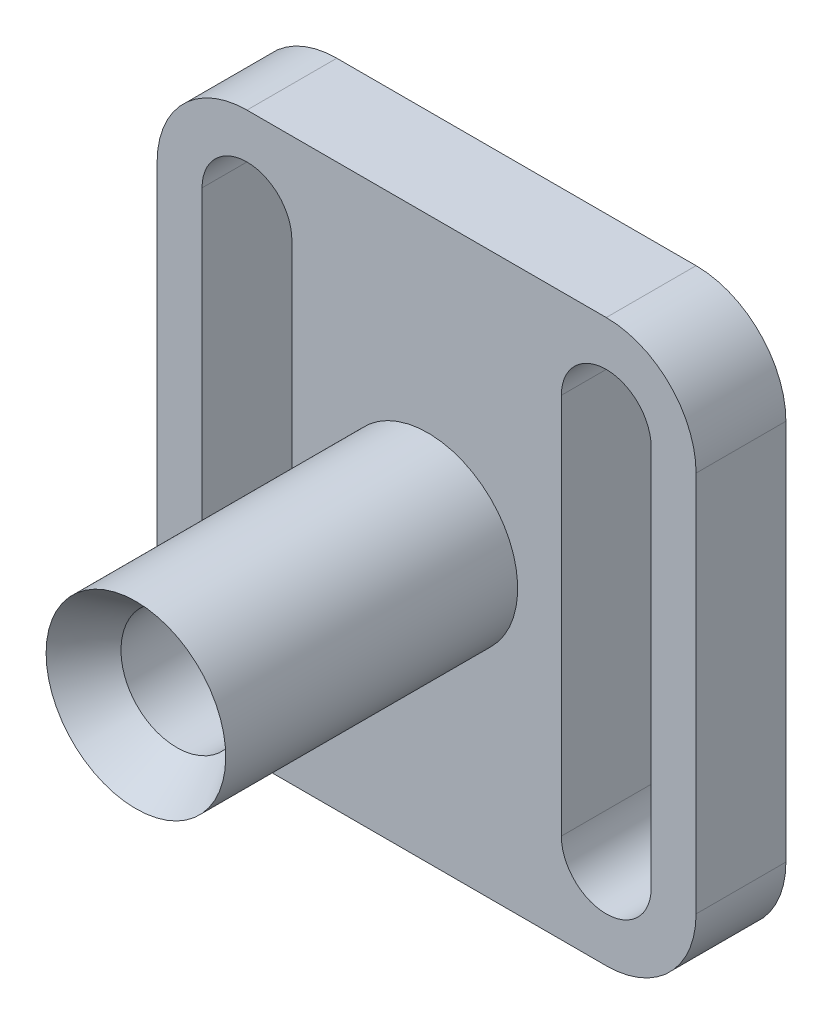
ISO-10303-21;
HEADER;
FILE_DESCRIPTION(('STEP AP214'),'2;1');
FILE_NAME('part.step','',(''),(''),'','','');
FILE_SCHEMA(('AUTOMOTIVE_DESIGN { 1 0 10303 214 1 1 1 1 }'));
ENDSEC;
DATA;
#1=APPLICATION_CONTEXT('core data for automotive mechanical design processes');
#2=APPLICATION_PROTOCOL_DEFINITION('international standard','automotive_design',2000,#1);
#3=PRODUCT_CONTEXT('',#1,'mechanical');
#4=PRODUCT('Part','Part','',(#3));
#5=PRODUCT_RELATED_PRODUCT_CATEGORY('part','',(#4));
#6=PRODUCT_DEFINITION_FORMATION('','',#4);
#7=PRODUCT_DEFINITION_CONTEXT('part definition',#1,'design');
#8=PRODUCT_DEFINITION('design','',#6,#7);
#9=PRODUCT_DEFINITION_SHAPE('','',#8);
#10=(LENGTH_UNIT() NAMED_UNIT(*) SI_UNIT(.MILLI.,.METRE.));
#11=(NAMED_UNIT(*) PLANE_ANGLE_UNIT() SI_UNIT($,.RADIAN.));
#12=(NAMED_UNIT(*) SI_UNIT($,.STERADIAN.) SOLID_ANGLE_UNIT());
#13=UNCERTAINTY_MEASURE_WITH_UNIT(LENGTH_MEASURE(1.E-05),#10,'distance_accuracy_value','');
#14=(GEOMETRIC_REPRESENTATION_CONTEXT(3) GLOBAL_UNCERTAINTY_ASSIGNED_CONTEXT((#13)) GLOBAL_UNIT_ASSIGNED_CONTEXT((#10,
#11,#12)) REPRESENTATION_CONTEXT('',''));
#15=CARTESIAN_POINT('',(0.,0.,0.));
#16=DIRECTION('',(0.,0.,1.));
#17=DIRECTION('',(1.,0.,0.));
#18=AXIS2_PLACEMENT_3D('',#15,#16,#17);
#19=CARTESIAN_POINT('',(6.35,6.35,6.35));
#20=DIRECTION('',(0.,0.,-1.));
#21=DIRECTION('',(-1.,0.,0.));
#22=AXIS2_PLACEMENT_3D('',#19,#20,#21);
#23=PLANE('',#22);
#24=CARTESIAN_POINT('',(19.1389366212312,19.9751458985905,6.35));
#25=DIRECTION('',(0.,0.,-1.));
#26=DIRECTION('',(-1.,0.,0.));
#27=AXIS2_PLACEMENT_3D('',#24,#25,#26);
#28=CIRCLE('',#27,6.35);
#29=CARTESIAN_POINT('',(12.7889366212312,19.9751458985905,6.35));
#30=VERTEX_POINT('',#29);
#31=EDGE_CURVE('E12',#30,#30,#28,.F.);
#32=ORIENTED_EDGE('',*,*,#31,.F.);
#33=EDGE_LOOP('',(#32));
#34=FACE_BOUND('',#33,.T.);
#35=CARTESIAN_POINT('',(6.35,33.3375,6.35));
#36=DIRECTION('',(0.,0.,1.));
#37=DIRECTION('',(1.,0.,0.));
#38=AXIS2_PLACEMENT_3D('',#35,#36,#37);
#39=CIRCLE('',#38,3.175);
#40=CARTESIAN_POINT('',(9.525,33.3375,6.35));
#41=VERTEX_POINT('',#40);
#42=CARTESIAN_POINT('',(3.175,33.3375,6.35));
#43=VERTEX_POINT('',#42);
#44=EDGE_CURVE('E192',#41,#43,#39,.T.);
#45=ORIENTED_EDGE('',*,*,#44,.F.);
#46=DIRECTION('',(0.,1.,0.));
#47=VECTOR('',#46,1.);
#48=CARTESIAN_POINT('',(9.525,33.3375,6.35));
#49=LINE('',#48,#47);
#50=CARTESIAN_POINT('',(9.52500000000001,6.35,6.35));
#51=VERTEX_POINT('',#50);
#52=EDGE_CURVE('E200',#51,#41,#49,.T.);
#53=ORIENTED_EDGE('',*,*,#52,.F.);
#54=CARTESIAN_POINT('',(6.35,6.35,6.35));
#55=DIRECTION('',(0.,0.,1.));
#56=DIRECTION('',(1.,0.,0.));
#57=AXIS2_PLACEMENT_3D('',#54,#55,#56);
#58=CIRCLE('',#57,3.175);
#59=CARTESIAN_POINT('',(3.175,6.35,6.35));
#60=VERTEX_POINT('',#59);
#61=EDGE_CURVE('E197',#60,#51,#58,.T.);
#62=ORIENTED_EDGE('',*,*,#61,.F.);
#63=DIRECTION('',(0.,-1.,0.));
#64=VECTOR('',#63,1.);
#65=CARTESIAN_POINT('',(3.175,33.3375,6.35));
#66=LINE('',#65,#64);
#67=EDGE_CURVE('E194',#43,#60,#66,.T.);
#68=ORIENTED_EDGE('',*,*,#67,.F.);
#69=EDGE_LOOP('',(#45,#53,#62,#68));
#70=FACE_BOUND('',#69,.T.);
#71=CARTESIAN_POINT('',(6.35,6.35,6.35));
#72=DIRECTION('',(0.,0.,1.));
#73=DIRECTION('',(-1.,0.,0.));
#74=AXIS2_PLACEMENT_3D('',#71,#72,#73);
#75=CIRCLE('',#74,6.35);
#76=CARTESIAN_POINT('',(0.,6.35,6.35));
#77=VERTEX_POINT('',#76);
#78=CARTESIAN_POINT('',(6.35,0.,6.35));
#79=VERTEX_POINT('',#78);
#80=EDGE_CURVE('E223',#77,#79,#75,.T.);
#81=ORIENTED_EDGE('',*,*,#80,.T.);
#82=DIRECTION('',(1.,0.,0.));
#83=VECTOR('',#82,1.);
#84=CARTESIAN_POINT('',(6.35,0.,6.35));
#85=LINE('',#84,#83);
#86=CARTESIAN_POINT('',(31.75,0.,6.35));
#87=VERTEX_POINT('',#86);
#88=EDGE_CURVE('E226',#79,#87,#85,.T.);
#89=ORIENTED_EDGE('',*,*,#88,.T.);
#90=CARTESIAN_POINT('',(31.75,6.35,6.35));
#91=DIRECTION('',(0.,0.,1.));
#92=DIRECTION('',(1.,0.,0.));
#93=AXIS2_PLACEMENT_3D('',#90,#91,#92);
#94=CIRCLE('',#93,6.35);
#95=CARTESIAN_POINT('',(38.1,6.35,6.35));
#96=VERTEX_POINT('',#95);
#97=EDGE_CURVE('E229',#87,#96,#94,.T.);
#98=ORIENTED_EDGE('',*,*,#97,.T.);
#99=DIRECTION('',(0.,1.,0.));
#100=VECTOR('',#99,1.);
#101=CARTESIAN_POINT('',(38.1,6.35,6.35));
#102=LINE('',#101,#100);
#103=CARTESIAN_POINT('',(38.1,33.3375,6.35));
#104=VERTEX_POINT('',#103);
#105=EDGE_CURVE('E231',#96,#104,#102,.T.);
#106=ORIENTED_EDGE('',*,*,#105,.T.);
#107=CARTESIAN_POINT('',(31.75,33.3375,6.35));
#108=DIRECTION('',(0.,0.,1.));
#109=DIRECTION('',(-1.,0.,0.));
#110=AXIS2_PLACEMENT_3D('',#107,#108,#109);
#111=CIRCLE('',#110,6.35);
#112=CARTESIAN_POINT('',(31.75,39.6875,6.35));
#113=VERTEX_POINT('',#112);
#114=EDGE_CURVE('E233',#104,#113,#111,.T.);
#115=ORIENTED_EDGE('',*,*,#114,.T.);
#116=DIRECTION('',(-1.,0.,0.));
#117=VECTOR('',#116,1.);
#118=CARTESIAN_POINT('',(6.35,39.6875,6.35));
#119=LINE('',#118,#117);
#120=CARTESIAN_POINT('',(6.35,39.6875,6.35));
#121=VERTEX_POINT('',#120);
#122=EDGE_CURVE('E235',#113,#121,#119,.T.);
#123=ORIENTED_EDGE('',*,*,#122,.T.);
#124=CARTESIAN_POINT('',(6.35,33.3375,6.35));
#125=DIRECTION('',(0.,0.,1.));
#126=DIRECTION('',(-1.,0.,0.));
#127=AXIS2_PLACEMENT_3D('',#124,#125,#126);
#128=CIRCLE('',#127,6.35);
#129=CARTESIAN_POINT('',(0.,33.3375,6.35));
#130=VERTEX_POINT('',#129);
#131=EDGE_CURVE('E237',#121,#130,#128,.T.);
#132=ORIENTED_EDGE('',*,*,#131,.T.);
#133=DIRECTION('',(0.,-1.,0.));
#134=VECTOR('',#133,1.);
#135=CARTESIAN_POINT('',(0.,6.35,6.35));
#136=LINE('',#135,#134);
#137=EDGE_CURVE('E239',#130,#77,#136,.T.);
#138=ORIENTED_EDGE('',*,*,#137,.T.);
#139=EDGE_LOOP('',(#81,#89,#98,#106,#115,#123,#132,#138));
#140=FACE_BOUND('',#139,.T.);
#141=CARTESIAN_POINT('',(31.75,33.3375,6.35));
#142=DIRECTION('',(0.,0.,1.));
#143=DIRECTION('',(1.,0.,0.));
#144=AXIS2_PLACEMENT_3D('',#141,#142,#143);
#145=CIRCLE('',#144,3.175);
#146=CARTESIAN_POINT('',(34.925,33.3375,6.35));
#147=VERTEX_POINT('',#146);
#148=CARTESIAN_POINT('',(28.575,33.3375,6.35));
#149=VERTEX_POINT('',#148);
#150=EDGE_CURVE('E154',#147,#149,#145,.T.);
#151=ORIENTED_EDGE('',*,*,#150,.F.);
#152=DIRECTION('',(0.,1.,0.));
#153=VECTOR('',#152,1.);
#154=CARTESIAN_POINT('',(34.925,33.3375,6.35));
#155=LINE('',#154,#153);
#156=CARTESIAN_POINT('',(34.925,6.35,6.35));
#157=VERTEX_POINT('',#156);
#158=EDGE_CURVE('E176',#157,#147,#155,.T.);
#159=ORIENTED_EDGE('',*,*,#158,.F.);
#160=CARTESIAN_POINT('',(31.75,6.35,6.35));
#161=DIRECTION('',(0.,0.,1.));
#162=DIRECTION('',(1.,0.,0.));
#163=AXIS2_PLACEMENT_3D('',#160,#161,#162);
#164=CIRCLE('',#163,3.175);
#165=CARTESIAN_POINT('',(28.575,6.35,6.35));
#166=VERTEX_POINT('',#165);
#167=EDGE_CURVE('E174',#166,#157,#164,.T.);
#168=ORIENTED_EDGE('',*,*,#167,.F.);
#169=DIRECTION('',(0.,-1.,0.));
#170=VECTOR('',#169,1.);
#171=CARTESIAN_POINT('',(28.575,33.3375,6.35));
#172=LINE('',#171,#170);
#173=EDGE_CURVE('E162',#149,#166,#172,.T.);
#174=ORIENTED_EDGE('',*,*,#173,.F.);
#175=EDGE_LOOP('',(#151,#159,#168,#174));
#176=FACE_BOUND('',#175,.T.);
#177=ADVANCED_FACE('F35',(#34,#70,#140,#176),#23,.F.);
#178=CARTESIAN_POINT('',(6.35,6.35,0.));
#179=DIRECTION('',(0.,0.,-1.));
#180=DIRECTION('',(-1.,0.,0.));
#181=AXIS2_PLACEMENT_3D('',#178,#179,#180);
#182=PLANE('',#181);
#183=CARTESIAN_POINT('',(19.05,19.84375,0.));
#184=DIRECTION('',(0.,0.,-1.));
#185=DIRECTION('',(-1.,0.,0.));
#186=AXIS2_PLACEMENT_3D('',#183,#184,#185);
#187=CIRCLE('',#186,4.12634201096532);
#188=CARTESIAN_POINT('',(14.9236579890347,19.84375,0.));
#189=VERTEX_POINT('',#188);
#190=EDGE_CURVE('E446',#189,#189,#187,.T.);
#191=ORIENTED_EDGE('',*,*,#190,.F.);
#192=EDGE_LOOP('',(#191));
#193=FACE_BOUND('',#192,.T.);
#194=CARTESIAN_POINT('',(6.35,6.35,0.));
#195=DIRECTION('',(0.,0.,1.));
#196=DIRECTION('',(-1.,0.,0.));
#197=AXIS2_PLACEMENT_3D('',#194,#195,#196);
#198=CIRCLE('',#197,6.35);
#199=CARTESIAN_POINT('',(0.,6.35,0.));
#200=VERTEX_POINT('',#199);
#201=CARTESIAN_POINT('',(6.35,0.,0.));
#202=VERTEX_POINT('',#201);
#203=EDGE_CURVE('E222',#200,#202,#198,.T.);
#204=ORIENTED_EDGE('',*,*,#203,.F.);
#205=DIRECTION('',(0.,-1.,0.));
#206=VECTOR('',#205,1.);
#207=CARTESIAN_POINT('',(0.,6.35,0.));
#208=LINE('',#207,#206);
#209=CARTESIAN_POINT('',(0.,33.3375,0.));
#210=VERTEX_POINT('',#209);
#211=EDGE_CURVE('E227',#210,#200,#208,.T.);
#212=ORIENTED_EDGE('',*,*,#211,.F.);
#213=CARTESIAN_POINT('',(6.35,33.3375,0.));
#214=DIRECTION('',(0.,0.,1.));
#215=DIRECTION('',(-1.,0.,0.));
#216=AXIS2_PLACEMENT_3D('',#213,#214,#215);
#217=CIRCLE('',#216,6.35);
#218=CARTESIAN_POINT('',(6.35,39.6875,0.));
#219=VERTEX_POINT('',#218);
#220=EDGE_CURVE('E254',#219,#210,#217,.T.);
#221=ORIENTED_EDGE('',*,*,#220,.F.);
#222=DIRECTION('',(-1.,0.,0.));
#223=VECTOR('',#222,1.);
#224=CARTESIAN_POINT('',(6.35,39.6875,0.));
#225=LINE('',#224,#223);
#226=CARTESIAN_POINT('',(31.75,39.6875,0.));
#227=VERTEX_POINT('',#226);
#228=EDGE_CURVE('E252',#227,#219,#225,.T.);
#229=ORIENTED_EDGE('',*,*,#228,.F.);
#230=CARTESIAN_POINT('',(31.75,33.3375,0.));
#231=DIRECTION('',(0.,0.,1.));
#232=DIRECTION('',(-1.,0.,0.));
#233=AXIS2_PLACEMENT_3D('',#230,#231,#232);
#234=CIRCLE('',#233,6.35);
#235=CARTESIAN_POINT('',(38.1,33.3375,0.));
#236=VERTEX_POINT('',#235);
#237=EDGE_CURVE('E250',#236,#227,#234,.T.);
#238=ORIENTED_EDGE('',*,*,#237,.F.);
#239=DIRECTION('',(0.,1.,0.));
#240=VECTOR('',#239,1.);
#241=CARTESIAN_POINT('',(38.1,6.35,0.));
#242=LINE('',#241,#240);
#243=CARTESIAN_POINT('',(38.1,6.35,0.));
#244=VERTEX_POINT('',#243);
#245=EDGE_CURVE('E248',#244,#236,#242,.T.);
#246=ORIENTED_EDGE('',*,*,#245,.F.);
#247=CARTESIAN_POINT('',(31.75,6.35,0.));
#248=DIRECTION('',(0.,0.,1.));
#249=DIRECTION('',(1.,0.,0.));
#250=AXIS2_PLACEMENT_3D('',#247,#248,#249);
#251=CIRCLE('',#250,6.35);
#252=CARTESIAN_POINT('',(31.75,0.,0.));
#253=VERTEX_POINT('',#252);
#254=EDGE_CURVE('E246',#253,#244,#251,.T.);
#255=ORIENTED_EDGE('',*,*,#254,.F.);
#256=DIRECTION('',(1.,0.,0.));
#257=VECTOR('',#256,1.);
#258=CARTESIAN_POINT('',(6.35,0.,0.));
#259=LINE('',#258,#257);
#260=EDGE_CURVE('E244',#202,#253,#259,.T.);
#261=ORIENTED_EDGE('',*,*,#260,.F.);
#262=EDGE_LOOP('',(#204,#212,#221,#229,#238,#246,#255,#261));
#263=FACE_BOUND('',#262,.T.);
#264=DIRECTION('',(0.,1.,0.));
#265=VECTOR('',#264,1.);
#266=CARTESIAN_POINT('',(9.525,33.3375,0.));
#267=LINE('',#266,#265);
#268=CARTESIAN_POINT('',(9.52500000000001,6.35,0.));
#269=VERTEX_POINT('',#268);
#270=CARTESIAN_POINT('',(9.525,33.3375,0.));
#271=VERTEX_POINT('',#270);
#272=EDGE_CURVE('E195',#269,#271,#267,.T.);
#273=ORIENTED_EDGE('',*,*,#272,.T.);
#274=CARTESIAN_POINT('',(6.35,33.3375,0.));
#275=DIRECTION('',(0.,0.,1.));
#276=DIRECTION('',(1.,0.,0.));
#277=AXIS2_PLACEMENT_3D('',#274,#275,#276);
#278=CIRCLE('',#277,3.175);
#279=CARTESIAN_POINT('',(3.175,33.3375,0.));
#280=VERTEX_POINT('',#279);
#281=EDGE_CURVE('E170',#271,#280,#278,.T.);
#282=ORIENTED_EDGE('',*,*,#281,.T.);
#283=DIRECTION('',(0.,-1.,0.));
#284=VECTOR('',#283,1.);
#285=CARTESIAN_POINT('',(3.175,33.3375,0.));
#286=LINE('',#285,#284);
#287=CARTESIAN_POINT('',(3.175,6.35,0.));
#288=VERTEX_POINT('',#287);
#289=EDGE_CURVE('E205',#280,#288,#286,.T.);
#290=ORIENTED_EDGE('',*,*,#289,.T.);
#291=CARTESIAN_POINT('',(6.35,6.35,0.));
#292=DIRECTION('',(0.,0.,1.));
#293=DIRECTION('',(1.,0.,0.));
#294=AXIS2_PLACEMENT_3D('',#291,#292,#293);
#295=CIRCLE('',#294,3.175);
#296=EDGE_CURVE('E208',#288,#269,#295,.T.);
#297=ORIENTED_EDGE('',*,*,#296,.T.);
#298=EDGE_LOOP('',(#273,#282,#290,#297));
#299=FACE_BOUND('',#298,.T.);
#300=DIRECTION('',(0.,1.,0.));
#301=VECTOR('',#300,1.);
#302=CARTESIAN_POINT('',(34.925,33.3375,0.));
#303=LINE('',#302,#301);
#304=CARTESIAN_POINT('',(34.925,6.35,0.));
#305=VERTEX_POINT('',#304);
#306=CARTESIAN_POINT('',(34.925,33.3375,0.));
#307=VERTEX_POINT('',#306);
#308=EDGE_CURVE('E163',#305,#307,#303,.T.);
#309=ORIENTED_EDGE('',*,*,#308,.T.);
#310=CARTESIAN_POINT('',(31.75,33.3375,0.));
#311=DIRECTION('',(0.,0.,1.));
#312=DIRECTION('',(1.,0.,0.));
#313=AXIS2_PLACEMENT_3D('',#310,#311,#312);
#314=CIRCLE('',#313,3.175);
#315=CARTESIAN_POINT('',(28.575,33.3375,0.));
#316=VERTEX_POINT('',#315);
#317=EDGE_CURVE('E64',#307,#316,#314,.T.);
#318=ORIENTED_EDGE('',*,*,#317,.T.);
#319=DIRECTION('',(0.,-1.,0.));
#320=VECTOR('',#319,1.);
#321=CARTESIAN_POINT('',(28.575,33.3375,0.));
#322=LINE('',#321,#320);
#323=CARTESIAN_POINT('',(28.575,6.35,0.));
#324=VERTEX_POINT('',#323);
#325=EDGE_CURVE('E169',#316,#324,#322,.T.);
#326=ORIENTED_EDGE('',*,*,#325,.T.);
#327=CARTESIAN_POINT('',(31.75,6.35,0.));
#328=DIRECTION('',(0.,0.,1.));
#329=DIRECTION('',(1.,0.,0.));
#330=AXIS2_PLACEMENT_3D('',#327,#328,#329);
#331=CIRCLE('',#330,3.175);
#332=EDGE_CURVE('E184',#324,#305,#331,.T.);
#333=ORIENTED_EDGE('',*,*,#332,.T.);
#334=EDGE_LOOP('',(#309,#318,#326,#333));
#335=FACE_BOUND('',#334,.T.);
#336=ADVANCED_FACE('F329',(#193,#263,#299,#335),#182,.T.);
#337=CARTESIAN_POINT('',(6.35,6.35,6.35));
#338=DIRECTION('',(0.,0.,-1.));
#339=DIRECTION('',(-1.,0.,0.));
#340=AXIS2_PLACEMENT_3D('',#337,#338,#339);
#341=CYLINDRICAL_SURFACE('',#340,6.35);
#342=ORIENTED_EDGE('',*,*,#203,.T.);
#343=DIRECTION('',(0.,0.,-1.));
#344=VECTOR('',#343,1.);
#345=CARTESIAN_POINT('',(6.35,0.,6.35));
#346=LINE('',#345,#344);
#347=EDGE_CURVE('E48',#79,#202,#346,.T.);
#348=ORIENTED_EDGE('',*,*,#347,.F.);
#349=ORIENTED_EDGE('',*,*,#80,.F.);
#350=DIRECTION('',(0.,0.,-1.));
#351=VECTOR('',#350,1.);
#352=CARTESIAN_POINT('',(0.,6.35,6.35));
#353=LINE('',#352,#351);
#354=EDGE_CURVE('E241',#77,#200,#353,.T.);
#355=ORIENTED_EDGE('',*,*,#354,.T.);
#356=EDGE_LOOP('',(#342,#348,#349,#355));
#357=FACE_BOUND('',#356,.T.);
#358=ADVANCED_FACE('F37',(#357),#341,.T.);
#359=CARTESIAN_POINT('',(6.35,0.,6.35));
#360=DIRECTION('',(0.,1.,0.));
#361=DIRECTION('',(-1.,0.,0.));
#362=AXIS2_PLACEMENT_3D('',#359,#360,#361);
#363=PLANE('',#362);
#364=ORIENTED_EDGE('',*,*,#260,.T.);
#365=DIRECTION('',(0.,0.,-1.));
#366=VECTOR('',#365,1.);
#367=CARTESIAN_POINT('',(31.75,0.,6.35));
#368=LINE('',#367,#366);
#369=EDGE_CURVE('E274',#87,#253,#368,.T.);
#370=ORIENTED_EDGE('',*,*,#369,.F.);
#371=ORIENTED_EDGE('',*,*,#88,.F.);
#372=ORIENTED_EDGE('',*,*,#347,.T.);
#373=EDGE_LOOP('',(#364,#370,#371,#372));
#374=FACE_BOUND('',#373,.T.);
#375=ADVANCED_FACE('F355',(#374),#363,.F.);
#376=CARTESIAN_POINT('',(31.75,6.35,6.35));
#377=DIRECTION('',(0.,0.,-1.));
#378=DIRECTION('',(-1.,0.,0.));
#379=AXIS2_PLACEMENT_3D('',#376,#377,#378);
#380=CYLINDRICAL_SURFACE('',#379,6.35);
#381=ORIENTED_EDGE('',*,*,#254,.T.);
#382=DIRECTION('',(0.,0.,-1.));
#383=VECTOR('',#382,1.);
#384=CARTESIAN_POINT('',(38.1,6.35,6.35));
#385=LINE('',#384,#383);
#386=EDGE_CURVE('E271',#96,#244,#385,.T.);
#387=ORIENTED_EDGE('',*,*,#386,.F.);
#388=ORIENTED_EDGE('',*,*,#97,.F.);
#389=ORIENTED_EDGE('',*,*,#369,.T.);
#390=EDGE_LOOP('',(#381,#387,#388,#389));
#391=FACE_BOUND('',#390,.T.);
#392=ADVANCED_FACE('F352',(#391),#380,.T.);
#393=CARTESIAN_POINT('',(38.1,6.35,6.35));
#394=DIRECTION('',(-1.,0.,0.));
#395=DIRECTION('',(0.,-1.,0.));
#396=AXIS2_PLACEMENT_3D('',#393,#394,#395);
#397=PLANE('',#396);
#398=ORIENTED_EDGE('',*,*,#245,.T.);
#399=DIRECTION('',(0.,0.,-1.));
#400=VECTOR('',#399,1.);
#401=CARTESIAN_POINT('',(38.1,33.3375,6.35));
#402=LINE('',#401,#400);
#403=EDGE_CURVE('E268',#104,#236,#402,.T.);
#404=ORIENTED_EDGE('',*,*,#403,.F.);
#405=ORIENTED_EDGE('',*,*,#105,.F.);
#406=ORIENTED_EDGE('',*,*,#386,.T.);
#407=EDGE_LOOP('',(#398,#404,#405,#406));
#408=FACE_BOUND('',#407,.T.);
#409=ADVANCED_FACE('F348',(#408),#397,.F.);
#410=CARTESIAN_POINT('',(31.75,33.3375,6.35));
#411=DIRECTION('',(0.,0.,-1.));
#412=DIRECTION('',(-1.,0.,0.));
#413=AXIS2_PLACEMENT_3D('',#410,#411,#412);
#414=CYLINDRICAL_SURFACE('',#413,6.35);
#415=ORIENTED_EDGE('',*,*,#237,.T.);
#416=DIRECTION('',(0.,0.,-1.));
#417=VECTOR('',#416,1.);
#418=CARTESIAN_POINT('',(31.75,39.6875,6.35));
#419=LINE('',#418,#417);
#420=EDGE_CURVE('E265',#113,#227,#419,.T.);
#421=ORIENTED_EDGE('',*,*,#420,.F.);
#422=ORIENTED_EDGE('',*,*,#114,.F.);
#423=ORIENTED_EDGE('',*,*,#403,.T.);
#424=EDGE_LOOP('',(#415,#421,#422,#423));
#425=FACE_BOUND('',#424,.T.);
#426=ADVANCED_FACE('F344',(#425),#414,.T.);
#427=CARTESIAN_POINT('',(6.35,39.6875,6.35));
#428=DIRECTION('',(0.,-1.,0.));
#429=DIRECTION('',(0.,0.,-1.));
#430=AXIS2_PLACEMENT_3D('',#427,#428,#429);
#431=PLANE('',#430);
#432=ORIENTED_EDGE('',*,*,#228,.T.);
#433=DIRECTION('',(0.,0.,-1.));
#434=VECTOR('',#433,1.);
#435=CARTESIAN_POINT('',(6.35,39.6875,6.35));
#436=LINE('',#435,#434);
#437=EDGE_CURVE('E262',#121,#219,#436,.T.);
#438=ORIENTED_EDGE('',*,*,#437,.F.);
#439=ORIENTED_EDGE('',*,*,#122,.F.);
#440=ORIENTED_EDGE('',*,*,#420,.T.);
#441=EDGE_LOOP('',(#432,#438,#439,#440));
#442=FACE_BOUND('',#441,.T.);
#443=ADVANCED_FACE('F340',(#442),#431,.F.);
#444=CARTESIAN_POINT('',(6.35,33.3375,6.35));
#445=DIRECTION('',(0.,0.,-1.));
#446=DIRECTION('',(-1.,0.,0.));
#447=AXIS2_PLACEMENT_3D('',#444,#445,#446);
#448=CYLINDRICAL_SURFACE('',#447,6.35);
#449=ORIENTED_EDGE('',*,*,#220,.T.);
#450=DIRECTION('',(0.,0.,-1.));
#451=VECTOR('',#450,1.);
#452=CARTESIAN_POINT('',(0.,33.3375,6.35));
#453=LINE('',#452,#451);
#454=EDGE_CURVE('E259',#130,#210,#453,.T.);
#455=ORIENTED_EDGE('',*,*,#454,.F.);
#456=ORIENTED_EDGE('',*,*,#131,.F.);
#457=ORIENTED_EDGE('',*,*,#437,.T.);
#458=EDGE_LOOP('',(#449,#455,#456,#457));
#459=FACE_BOUND('',#458,.T.);
#460=ADVANCED_FACE('F336',(#459),#448,.T.);
#461=CARTESIAN_POINT('',(0.,6.35,6.35));
#462=DIRECTION('',(1.,0.,0.));
#463=DIRECTION('',(0.,1.,0.));
#464=AXIS2_PLACEMENT_3D('',#461,#462,#463);
#465=PLANE('',#464);
#466=ORIENTED_EDGE('',*,*,#211,.T.);
#467=ORIENTED_EDGE('',*,*,#354,.F.);
#468=ORIENTED_EDGE('',*,*,#137,.F.);
#469=ORIENTED_EDGE('',*,*,#454,.T.);
#470=EDGE_LOOP('',(#466,#467,#468,#469));
#471=FACE_BOUND('',#470,.T.);
#472=ADVANCED_FACE('F325',(#471),#465,.F.);
#473=CARTESIAN_POINT('',(6.35,33.3375,6.35));
#474=DIRECTION('',(0.,0.,-1.));
#475=DIRECTION('',(-1.,0.,0.));
#476=AXIS2_PLACEMENT_3D('',#473,#474,#475);
#477=CYLINDRICAL_SURFACE('',#476,3.175);
#478=ORIENTED_EDGE('',*,*,#281,.F.);
#479=DIRECTION('',(0.,0.,-1.));
#480=VECTOR('',#479,1.);
#481=CARTESIAN_POINT('',(9.525,33.3375,6.35));
#482=LINE('',#481,#480);
#483=EDGE_CURVE('E202',#41,#271,#482,.T.);
#484=ORIENTED_EDGE('',*,*,#483,.F.);
#485=ORIENTED_EDGE('',*,*,#44,.T.);
#486=DIRECTION('',(0.,0.,-1.));
#487=VECTOR('',#486,1.);
#488=CARTESIAN_POINT('',(3.175,33.3375,6.35));
#489=LINE('',#488,#487);
#490=EDGE_CURVE('E219',#43,#280,#489,.T.);
#491=ORIENTED_EDGE('',*,*,#490,.T.);
#492=EDGE_LOOP('',(#478,#484,#485,#491));
#493=FACE_BOUND('',#492,.T.);
#494=ADVANCED_FACE('F321',(#493),#477,.F.);
#495=CARTESIAN_POINT('',(3.175,33.3375,6.35));
#496=DIRECTION('',(1.,0.,0.));
#497=DIRECTION('',(0.,1.,0.));
#498=AXIS2_PLACEMENT_3D('',#495,#496,#497);
#499=PLANE('',#498);
#500=ORIENTED_EDGE('',*,*,#289,.F.);
#501=ORIENTED_EDGE('',*,*,#490,.F.);
#502=ORIENTED_EDGE('',*,*,#67,.T.);
#503=DIRECTION('',(0.,0.,-1.));
#504=VECTOR('',#503,1.);
#505=CARTESIAN_POINT('',(3.175,6.35,6.35));
#506=LINE('',#505,#504);
#507=EDGE_CURVE('E217',#60,#288,#506,.T.);
#508=ORIENTED_EDGE('',*,*,#507,.T.);
#509=EDGE_LOOP('',(#500,#501,#502,#508));
#510=FACE_BOUND('',#509,.T.);
#511=ADVANCED_FACE('F317',(#510),#499,.T.);
#512=CARTESIAN_POINT('',(6.35,6.35,6.35));
#513=DIRECTION('',(0.,0.,-1.));
#514=DIRECTION('',(-1.,0.,0.));
#515=AXIS2_PLACEMENT_3D('',#512,#513,#514);
#516=CYLINDRICAL_SURFACE('',#515,3.175);
#517=ORIENTED_EDGE('',*,*,#296,.F.);
#518=ORIENTED_EDGE('',*,*,#507,.F.);
#519=ORIENTED_EDGE('',*,*,#61,.T.);
#520=DIRECTION('',(0.,0.,-1.));
#521=VECTOR('',#520,1.);
#522=CARTESIAN_POINT('',(9.52500000000001,6.35,6.35));
#523=LINE('',#522,#521);
#524=EDGE_CURVE('E215',#51,#269,#523,.T.);
#525=ORIENTED_EDGE('',*,*,#524,.T.);
#526=EDGE_LOOP('',(#517,#518,#519,#525));
#527=FACE_BOUND('',#526,.T.);
#528=ADVANCED_FACE('F313',(#527),#516,.F.);
#529=CARTESIAN_POINT('',(9.525,33.3375,6.35));
#530=DIRECTION('',(-1.,0.,0.));
#531=DIRECTION('',(0.,-1.,0.));
#532=AXIS2_PLACEMENT_3D('',#529,#530,#531);
#533=PLANE('',#532);
#534=ORIENTED_EDGE('',*,*,#272,.F.);
#535=ORIENTED_EDGE('',*,*,#524,.F.);
#536=ORIENTED_EDGE('',*,*,#52,.T.);
#537=ORIENTED_EDGE('',*,*,#483,.T.);
#538=EDGE_LOOP('',(#534,#535,#536,#537));
#539=FACE_BOUND('',#538,.T.);
#540=ADVANCED_FACE('F310',(#539),#533,.T.);
#541=CARTESIAN_POINT('',(31.75,33.3375,6.35));
#542=DIRECTION('',(0.,0.,-1.));
#543=DIRECTION('',(-1.,0.,0.));
#544=AXIS2_PLACEMENT_3D('',#541,#542,#543);
#545=CYLINDRICAL_SURFACE('',#544,3.175);
#546=ORIENTED_EDGE('',*,*,#317,.F.);
#547=DIRECTION('',(0.,0.,-1.));
#548=VECTOR('',#547,1.);
#549=CARTESIAN_POINT('',(34.925,33.3375,6.35));
#550=LINE('',#549,#548);
#551=EDGE_CURVE('E158',#147,#307,#550,.T.);
#552=ORIENTED_EDGE('',*,*,#551,.F.);
#553=ORIENTED_EDGE('',*,*,#150,.T.);
#554=DIRECTION('',(0.,0.,-1.));
#555=VECTOR('',#554,1.);
#556=CARTESIAN_POINT('',(28.575,33.3375,6.35));
#557=LINE('',#556,#555);
#558=EDGE_CURVE('E157',#149,#316,#557,.T.);
#559=ORIENTED_EDGE('',*,*,#558,.T.);
#560=EDGE_LOOP('',(#546,#552,#553,#559));
#561=FACE_BOUND('',#560,.T.);
#562=ADVANCED_FACE('F156',(#561),#545,.F.);
#563=CARTESIAN_POINT('',(28.575,33.3375,6.35));
#564=DIRECTION('',(1.,0.,0.));
#565=DIRECTION('',(0.,0.,-1.));
#566=AXIS2_PLACEMENT_3D('',#563,#564,#565);
#567=PLANE('',#566);
#568=ORIENTED_EDGE('',*,*,#325,.F.);
#569=ORIENTED_EDGE('',*,*,#558,.F.);
#570=ORIENTED_EDGE('',*,*,#173,.T.);
#571=DIRECTION('',(0.,0.,-1.));
#572=VECTOR('',#571,1.);
#573=CARTESIAN_POINT('',(28.575,6.35,6.35));
#574=LINE('',#573,#572);
#575=EDGE_CURVE('E171',#166,#324,#574,.T.);
#576=ORIENTED_EDGE('',*,*,#575,.T.);
#577=EDGE_LOOP('',(#568,#569,#570,#576));
#578=FACE_BOUND('',#577,.T.);
#579=ADVANCED_FACE('F166',(#578),#567,.T.);
#580=CARTESIAN_POINT('',(31.75,6.35,6.35));
#581=DIRECTION('',(0.,0.,-1.));
#582=DIRECTION('',(-1.,0.,0.));
#583=AXIS2_PLACEMENT_3D('',#580,#581,#582);
#584=CYLINDRICAL_SURFACE('',#583,3.175);
#585=ORIENTED_EDGE('',*,*,#332,.F.);
#586=ORIENTED_EDGE('',*,*,#575,.F.);
#587=ORIENTED_EDGE('',*,*,#167,.T.);
#588=DIRECTION('',(0.,0.,-1.));
#589=VECTOR('',#588,1.);
#590=CARTESIAN_POINT('',(34.925,6.35,6.35));
#591=LINE('',#590,#589);
#592=EDGE_CURVE('E56',#157,#305,#591,.T.);
#593=ORIENTED_EDGE('',*,*,#592,.T.);
#594=EDGE_LOOP('',(#585,#586,#587,#593));
#595=FACE_BOUND('',#594,.T.);
#596=ADVANCED_FACE('F302',(#595),#584,.F.);
#597=CARTESIAN_POINT('',(34.925,33.3375,6.35));
#598=DIRECTION('',(-1.,0.,0.));
#599=DIRECTION('',(0.,-1.,0.));
#600=AXIS2_PLACEMENT_3D('',#597,#598,#599);
#601=PLANE('',#600);
#602=ORIENTED_EDGE('',*,*,#308,.F.);
#603=ORIENTED_EDGE('',*,*,#592,.F.);
#604=ORIENTED_EDGE('',*,*,#158,.T.);
#605=ORIENTED_EDGE('',*,*,#551,.T.);
#606=EDGE_LOOP('',(#602,#603,#604,#605));
#607=FACE_BOUND('',#606,.T.);
#608=ADVANCED_FACE('F296',(#607),#601,.T.);
#609=CARTESIAN_POINT('',(19.1389366212312,19.9751458985905,26.9875));
#610=DIRECTION('',(0.,0.,-1.));
#611=DIRECTION('',(-1.,0.,0.));
#612=AXIS2_PLACEMENT_3D('',#609,#610,#611);
#613=CYLINDRICAL_SURFACE('',#612,6.35);
#614=CARTESIAN_POINT('',(19.1389366212312,19.9751458985905,26.9875));
#615=DIRECTION('',(0.,0.,1.));
#616=DIRECTION('',(1.,0.,0.));
#617=AXIS2_PLACEMENT_3D('',#614,#615,#616);
#618=CIRCLE('',#617,6.35);
#619=CARTESIAN_POINT('',(23.2750542304949,15.1569479862649,26.9875));
#620=VERTEX_POINT('',#619);
#621=EDGE_CURVE('E182',#620,#620,#618,.T.);
#622=ORIENTED_EDGE('',*,*,#621,.F.);
#623=EDGE_LOOP('',(#622));
#624=FACE_BOUND('',#623,.T.);
#625=ORIENTED_EDGE('',*,*,#31,.T.);
#626=EDGE_LOOP('',(#625));
#627=FACE_BOUND('',#626,.T.);
#628=ADVANCED_FACE('F286',(#624,#627),#613,.T.);
#629=CARTESIAN_POINT('',(23.2750542304949,15.1569479862649,26.9875));
#630=CARTESIAN_POINT('',(21.6659075219435,18.0528964176559,22.225));
#631=CARTESIAN_POINT('',(13.6386584058436,6.88471276773761,26.9875));
#632=CARTESIAN_POINT('',(17.8214085600741,12.9989546162314,22.225));
#633=CARTESIAN_POINT('',(5.36642318731631,16.5211085923889,26.9875));
#634=CARTESIAN_POINT('',(12.7674667586496,16.8434535781008,22.225));
#635=CARTESIAN_POINT('',(15.0028190119676,24.7933438109162,26.9875));
#636=CARTESIAN_POINT('',(16.611965720519,21.8973953795252,22.225));
#637=CARTESIAN_POINT('',(24.6392148366188,33.0655790294435,26.9875));
#638=CARTESIAN_POINT('',(20.4564646823884,26.9513371809497,22.225));
#639=CARTESIAN_POINT('',(32.9114500551461,23.4291832047922,26.9875));
#640=CARTESIAN_POINT('',(25.5104064838128,23.1068382190803,22.225));
#641=CARTESIAN_POINT('',(23.2750542304949,15.1569479862649,26.9875));
#642=CARTESIAN_POINT('',(21.6659075219435,18.0528964176559,22.225));
#643=(BOUNDED_SURFACE() B_SPLINE_SURFACE(3,1,((#629,#630),(#631,#632),(#633,#634),(#635,#636),
(#637,#638),(#639,#640),(#641,#642)),.UNSPECIFIED.,.T.,.F.,.F.) B_SPLINE_SURFACE_WITH_KNOTS((4,
3,4),(2,2),(0.,0.5,1.),(0.,1.),
.UNSPECIFIED.) GEOMETRIC_REPRESENTATION_ITEM() RATIONAL_B_SPLINE_SURFACE(((1.,1.),
(0.333333333333333,0.333333333333333),(0.333333333333333,0.333333333333333),(1.,1.),
(0.333333333333334,0.333333333333334),(0.333333333333334,0.333333333333334),(1.,1.))) REPRESENTATION_ITEM('') SURFACE());
#644=CARTESIAN_POINT('',(22.1708009360448,17.1442500631525,23.7193043240737));
#645=CARTESIAN_POINT('',(22.0190330111052,16.9688119041516,23.7326153809966));
#646=CARTESIAN_POINT('',(21.8523202815343,16.8060658384151,23.7457559495601));
#647=CARTESIAN_POINT('',(21.4937420355011,16.5107494302321,23.7713255783631));
#648=CARTESIAN_POINT('',(21.3018466281493,16.3782154683167,23.7837537674428));
#649=CARTESIAN_POINT('',(20.8985196046114,16.1473162021056,23.8075467888706));
#650=CARTESIAN_POINT('',(20.6870963513511,16.0489363562003,23.8189120722567));
#651=CARTESIAN_POINT('',(20.2507146916883,15.8891364359893,23.840278252273));
#652=CARTESIAN_POINT('',(20.0257596972005,15.8277070875384,23.8502794907751));
#653=CARTESIAN_POINT('',(19.5688538924089,15.7435792738106,23.8686507600337));
#654=CARTESIAN_POINT('',(19.3369092582574,15.7208475800749,23.8770221847833));
#655=CARTESIAN_POINT('',(18.8724308763878,15.7146927556494,23.8919273819965));
#656=CARTESIAN_POINT('',(18.6398971105197,15.7312708511085,23.8984610971313));
#657=CARTESIAN_POINT('',(18.1812400849408,15.8032356112266,23.9095135688752));
#658=CARTESIAN_POINT('',(17.9551073287753,15.8585612704542,23.9140354746665));
#659=CARTESIAN_POINT('',(17.5153103852867,16.006401381132,23.9209638950951));
#660=CARTESIAN_POINT('',(17.3016460796575,16.0989154796562,23.9233704298072));
#661=CARTESIAN_POINT('',(16.8931114777565,16.3183799081836,23.9260054025727));
#662=CARTESIAN_POINT('',(16.6982195002342,16.4452898500499,23.9262363838934));
#663=CARTESIAN_POINT('',(16.332484140056,16.7299887176533,23.9245210510203));
#664=CARTESIAN_POINT('',(16.1616406350369,16.8877774862632,23.9225747479054));
#665=CARTESIAN_POINT('',(15.848900022191,17.2296885385949,23.9165552450325));
#666=CARTESIAN_POINT('',(15.706993317986,17.4138020576077,23.9124827519883));
#667=CARTESIAN_POINT('',(15.4560650234779,17.8031684444583,23.902314838024));
#668=CARTESIAN_POINT('',(15.3470435316274,18.0084213755812,23.8962194110478));
#669=CARTESIAN_POINT('',(15.1648948272411,18.4343730726605,23.8821569498454));
#670=CARTESIAN_POINT('',(15.09179033299,18.655081513999,23.8741887357385));
#671=CARTESIAN_POINT('',(14.9836202982855,19.1055663823884,23.8565881940229));
#672=CARTESIAN_POINT('',(14.9485549898834,19.3353428647485,23.8469558562629));
#673=CARTESIAN_POINT('',(14.9174028060472,19.7977722105964,23.8262637802111));
#674=CARTESIAN_POINT('',(14.9213687501584,20.0304285462087,23.8152021276505));
#675=CARTESIAN_POINT('',(14.9682628259726,20.4917234232896,23.7919538957001));
#676=CARTESIAN_POINT('',(15.0111912970051,20.7203619297486,23.7797673065139));
#677=CARTESIAN_POINT('',(15.134867494998,21.1675046195892,23.7545765938768));
#678=CARTESIAN_POINT('',(15.2156734243031,21.385992635899,23.7415712390314));
#679=CARTESIAN_POINT('',(15.4128196576101,21.806272397427,23.7151159088665));
#680=CARTESIAN_POINT('',(15.5291602154367,22.0080640233694,23.7016659303718));
#681=CARTESIAN_POINT('',(15.7942199928079,22.3894484847309,23.6746820047554));
#682=CARTESIAN_POINT('',(15.9429743371501,22.5690169046631,23.6611479821384));
#683=CARTESIAN_POINT('',(16.2685700481002,22.9006007038738,23.6343972122141));
#684=CARTESIAN_POINT('',(16.4454114874708,23.0526160117708,23.6211804657289));
#685=CARTESIAN_POINT('',(16.822196890812,23.3247856901275,23.5954487542975));
#686=CARTESIAN_POINT('',(17.0221439347208,23.4449358059606,23.5829338832411));
#687=CARTESIAN_POINT('',(17.4394515657238,23.6499123202888,23.5589822176462));
#688=CARTESIAN_POINT('',(17.6568120865461,23.7347388532099,23.547545419005));
#689=CARTESIAN_POINT('',(18.1025601995525,23.8665627313162,23.526110013066));
#690=CARTESIAN_POINT('',(18.3309371338266,23.9135958916555,23.5161100515386));
#691=CARTESIAN_POINT('',(18.7924165879591,23.9685948049542,23.4978474363734));
#692=CARTESIAN_POINT('',(19.0255190687627,23.9765608806557,23.4895847683839));
#693=CARTESIAN_POINT('',(19.4894195158695,23.9531851532941,23.4750714693466));
#694=CARTESIAN_POINT('',(19.7202206664617,23.9219086084153,23.4688175196179));
#695=CARTESIAN_POINT('',(20.1733373789864,23.8210208092799,23.4585042208686));
#696=CARTESIAN_POINT('',(20.3956530322624,23.7514099678035,23.4544448482178));
#697=CARTESIAN_POINT('',(20.8251088333385,23.5759616988577,23.448657454183));
#698=CARTESIAN_POINT('',(21.032272973218,23.4701831189678,23.4469256680736));
#699=CARTESIAN_POINT('',(21.4259289161708,23.2253743763131,23.4458377355123));
#700=CARTESIAN_POINT('',(21.6124208067186,23.0863443542596,23.4464815790076));
#701=CARTESIAN_POINT('',(21.9592935540671,22.7791112584433,23.4501223858785));
#702=CARTESIAN_POINT('',(22.1196949740899,22.6109313772455,23.4531174851554));
#703=CARTESIAN_POINT('',(22.410026041558,22.250105249354,23.4613611386211));
#704=CARTESIAN_POINT('',(22.5399556056746,22.0574589357566,23.4666096989721));
#705=CARTESIAN_POINT('',(22.7657315817984,21.6530829150688,23.4791940511758));
#706=CARTESIAN_POINT('',(22.8615625377803,21.4413446084317,23.4865307868397));
#707=CARTESIAN_POINT('',(23.0163708953205,21.004877029599,23.5030568860734));
#708=CARTESIAN_POINT('',(23.0753494920081,20.7801481789476,23.5122461895512));
#709=CARTESIAN_POINT('',(23.1548784407431,20.3237512807732,23.5322035992466));
#710=CARTESIAN_POINT('',(23.1753774471157,20.0920743799857,23.5429737943253));
#711=CARTESIAN_POINT('',(23.1772400510826,19.6285616109441,23.5657564058791));
#712=CARTESIAN_POINT('',(23.1585935732413,19.3967257171209,23.5777691414081));
#713=CARTESIAN_POINT('',(23.0826321949993,18.9390210052297,23.6026994695805));
#714=CARTESIAN_POINT('',(23.0252318253111,18.7131665254004,23.6156190055635));
#715=CARTESIAN_POINT('',(22.8733485732348,18.274530232657,23.6419487518583));
#716=CARTESIAN_POINT('',(22.7789099330382,18.0617331720834,23.6553583595141));
#717=CARTESIAN_POINT('',(22.5974889997361,17.7311250109455,23.6772502783168));
#718=CARTESIAN_POINT('',(22.5208782477524,17.6075041654,23.6857037091647));
#719=CARTESIAN_POINT('',(22.3550665341439,17.3690122983817,23.7025618319831));
#720=CARTESIAN_POINT('',(22.2658655606711,17.254141285143,23.7109665239078));
#721=CARTESIAN_POINT('',(22.1708009360448,17.1442500631525,23.7193043240737));
#722=B_SPLINE_CURVE_WITH_KNOTS('',3,(#644,#645,#646,#647,#648,#649,#650,#651,#652,#653,#654,
#655,#656,#657,#658,#659,#660,#661,#662,#663,#664,#665,#666,#667,#668,#669,#670,#671,#672,#673,
#674,#675,#676,#677,#678,#679,#680,#681,#682,#683,#684,#685,#686,#687,#688,#689,#690,#691,#692,
#693,#694,#695,#696,#697,#698,#699,#700,#701,#702,#703,#704,#705,#706,#707,#708,#709,#710,#711,
#712,#713,#714,#715,#716,#717,#718,#719,#720,#721),.UNSPECIFIED.,.T.,.F.,(4,2,2,2,2,2,2,2,2,2,2,
2,2,2,2,2,2,2,2,2,2,2,2,2,2,2,2,2,2,2,2,2,2,2,2,2,2,2,4),(0.,0.696537012862019,1.39390839596003,
2.09098249790177,2.7878815692665,3.48418193292219,4.18050401582691,4.87573224386588,
5.57095387420097,6.26536267496595,6.95976794231809,7.65394254657349,8.34811922904604,
9.04273442994066,9.73735386818715,10.432913438252,11.1284790660895,11.8251170185121,
12.5217599471524,13.2191615721062,13.9165650037821,14.6140615056326,15.3115553530908,
16.0083874335053,16.7052137572239,17.4008828337984,18.0965444196197,18.7910794568934,
19.4856115551304,20.1795935768669,20.8735774963491,21.5678755814348,22.2621511491259,
22.9573524745104,23.6527327557829,24.3496516863126,25.0457406707025,25.4820381780969,
25.918336096069),.UNSPECIFIED.);
#723=CARTESIAN_POINT('',(22.1708009360448,17.1442500631525,23.7193043240737));
#724=VERTEX_POINT('',#723);
#725=EDGE_CURVE('E39',#724,#724,#722,.T.);
#726=CARTESIAN_POINT('',(22.1708009360448,17.1442500631525,23.7193043240737));
#727=CARTESIAN_POINT('',(22.1823035745286,17.1235489998516,23.7533480290313));
#728=CARTESIAN_POINT('',(22.1938062130125,17.1028479365507,23.7873917339889));
#729=CARTESIAN_POINT('',(22.2168114899802,17.0614458099489,23.855479143904));
#730=CARTESIAN_POINT('',(22.228314128464,17.040744746648,23.8895228488616));
#731=CARTESIAN_POINT('',(22.2513194054317,16.9993426200461,23.9576102587767));
#732=CARTESIAN_POINT('',(22.2628220439156,16.9786415567452,23.9916539637343));
#733=CARTESIAN_POINT('',(22.2858273208833,16.9372394301434,24.0597413736494));
#734=CARTESIAN_POINT('',(22.2973299593672,16.9165383668425,24.093785078607));
#735=CARTESIAN_POINT('',(22.3203352363349,16.8751362402407,24.1618724885221));
#736=CARTESIAN_POINT('',(22.3318378748187,16.8544351769398,24.1959161934797));
#737=CARTESIAN_POINT('',(22.3548431517864,16.8130330503379,24.2640036033948));
#738=CARTESIAN_POINT('',(22.3663457902703,16.792331987037,24.2980473083524));
#739=CARTESIAN_POINT('',(22.389351067238,16.7509298604352,24.3661347182675));
#740=CARTESIAN_POINT('',(22.4008537057219,16.7302287971343,24.4001784232251));
#741=CARTESIAN_POINT('',(22.4238589826896,16.6888266705325,24.4682658331402));
#742=CARTESIAN_POINT('',(22.4353616211734,16.6681256072315,24.5023095380977));
#743=CARTESIAN_POINT('',(22.4583668981411,16.6267234806297,24.5703969480129));
#744=CARTESIAN_POINT('',(22.469869536625,16.6060224173288,24.6044406529704));
#745=CARTESIAN_POINT('',(22.4928748135927,16.564620290727,24.6725280628856));
#746=CARTESIAN_POINT('',(22.5043774520766,16.5439192274261,24.7065717678431));
#747=CARTESIAN_POINT('',(22.5273827290443,16.5025171008242,24.7746591777583));
#748=CARTESIAN_POINT('',(22.5388853675281,16.4818160375233,24.8087028827158));
#749=CARTESIAN_POINT('',(22.5618906444958,16.4404139109215,24.876790292631));
#750=CARTESIAN_POINT('',(22.5733932829797,16.4197128476206,24.9108339975885));
#751=CARTESIAN_POINT('',(22.5963985599474,16.3783107210188,24.9789214075037));
#752=CARTESIAN_POINT('',(22.6079011984313,16.3576096577179,25.0129651124612));
#753=CARTESIAN_POINT('',(22.630906475399,16.316207531116,25.0810525223764));
#754=CARTESIAN_POINT('',(22.6424091138828,16.2955064678151,25.1150962273339));
#755=CARTESIAN_POINT('',(22.6654143908505,16.2541043412133,25.1831836372491));
#756=CARTESIAN_POINT('',(22.6769170293344,16.2334032779124,25.2172273422066));
#757=CARTESIAN_POINT('',(22.6999223063021,16.1920011513106,25.2853147521217));
#758=CARTESIAN_POINT('',(22.711424944786,16.1713000880096,25.3193584570793));
#759=CARTESIAN_POINT('',(22.7344302217537,16.1298979614078,25.3874458669944));
#760=CARTESIAN_POINT('',(22.7459328602375,16.1091968981069,25.421489571952));
#761=CARTESIAN_POINT('',(22.7689381372052,16.0677947715051,25.4895769818671));
#762=CARTESIAN_POINT('',(22.7804407756891,16.0470937082042,25.5236206868247));
#763=CARTESIAN_POINT('',(22.8034460526568,16.0056915816023,25.5917080967398));
#764=CARTESIAN_POINT('',(22.8149486911407,15.9849905183014,25.6257518016974));
#765=CARTESIAN_POINT('',(22.8379539681084,15.9435883916996,25.6938392116125));
#766=CARTESIAN_POINT('',(22.8494566065922,15.9228873283987,25.7278829165701));
#767=CARTESIAN_POINT('',(22.8724618835599,15.8814852017969,25.7959703264852));
#768=CARTESIAN_POINT('',(22.8839645220438,15.8607841384959,25.8300140314428));
#769=CARTESIAN_POINT('',(22.9069697990115,15.8193820118941,25.8981014413579));
#770=CARTESIAN_POINT('',(22.9184724374954,15.7986809485932,25.9321451463155));
#771=CARTESIAN_POINT('',(22.9414777144631,15.7572788219914,26.0002325562306));
#772=CARTESIAN_POINT('',(22.9529803529469,15.7365777586905,26.0342762611882));
#773=CARTESIAN_POINT('',(22.9759856299146,15.6951756320886,26.1023636711033));
#774=CARTESIAN_POINT('',(22.9874882683985,15.6744745687877,26.1364073760609));
#775=CARTESIAN_POINT('',(23.0104935453662,15.6330724421859,26.204494785976));
#776=CARTESIAN_POINT('',(23.0219961838501,15.612371378885,26.2385384909336));
#777=CARTESIAN_POINT('',(23.0450014608178,15.5709692522832,26.3066259008487));
#778=CARTESIAN_POINT('',(23.0565040993016,15.5502681889823,26.3406696058063));
#779=CARTESIAN_POINT('',(23.0795093762693,15.5088660623804,26.4087570157214));
#780=CARTESIAN_POINT('',(23.0910120147532,15.4881649990795,26.442800720679));
#781=CARTESIAN_POINT('',(23.1140172917209,15.4467628724777,26.5108881305941));
#782=CARTESIAN_POINT('',(23.1255199302048,15.4260618091768,26.5449318355517));
#783=CARTESIAN_POINT('',(23.1485252071725,15.384659682575,26.6130192454668));
#784=CARTESIAN_POINT('',(23.1600278456563,15.363958619274,26.6470629504243));
#785=CARTESIAN_POINT('',(23.183033122624,15.3225564926722,26.7151503603395));
#786=CARTESIAN_POINT('',(23.1945357611079,15.3018554293713,26.749194065297));
#787=CARTESIAN_POINT('',(23.2175410380756,15.2604533027695,26.8172814752122));
#788=CARTESIAN_POINT('',(23.2290436765595,15.2397522394686,26.8513251801697));
#789=CARTESIAN_POINT('',(23.2520489535272,15.1983501128667,26.9194125900849));
#790=CARTESIAN_POINT('',(23.263551592011,15.1776490495658,26.9534562950424));
#791=CARTESIAN_POINT('',(23.2750542304949,15.1569479862649,26.9875));
#792=B_SPLINE_CURVE_WITH_KNOTS('',3,(#726,#727,#728,#729,#730,#731,#732,#733,#734,#735,#736,
#737,#738,#739,#740,#741,#742,#743,#744,#745,#746,#747,#748,#749,#750,#751,#752,#753,#754,#755,
#756,#757,#758,#759,#760,#761,#762,#763,#764,#765,#766,#767,#768,#769,#770,#771,#772,#773,#774,
#775,#776,#777,#778,#779,#780,#781,#782,#783,#784,#785,#786,#787,#788,#789,#790,#791),
.UNSPECIFIED.,.F.,.F.,(4,2,2,2,2,2,2,2,2,2,2,2,2,2,2,2,2,2,2,2,2,2,2,2,2,2,2,2,2,2,2,2,4),(0.,
0.124412085626952,0.248824171253901,0.373236256880853,0.497648342507804,0.622060428134755,
0.746472513761705,0.870884599388658,0.995296685015607,1.11970877064256,1.24412085626951,
1.36853294189646,1.49294502752341,1.61735711315036,1.74176919877731,1.86618128440427,
1.99059337003121,2.11500545565816,2.23941754128511,2.36382962691207,2.48824171253902,
2.61265379816597,2.73706588379292,2.86147796941987,2.98589005504682,3.11030214067377,
3.23471422630072,3.35912631192767,3.48353839755462,3.60795048318157,3.73236256880853,
3.85677465443548,3.98118674006243),.UNSPECIFIED.);
#793=EDGE_CURVE('BSEAM295',#724,#620,#792,.T.);
#794=ORIENTED_EDGE('',*,*,#725,.T.);
#795=ORIENTED_EDGE('',*,*,#621,.T.);
#796=ORIENTED_EDGE('',*,*,#793,.T.);
#797=ORIENTED_EDGE('',*,*,#793,.F.);
#798=EDGE_LOOP('',(#794,#796,#795,#797));
#799=FACE_BOUND('',#798,.T.);
#800=ADVANCED_FACE('F295',(#799),#643,.F.);
#801=CARTESIAN_POINT('',(19.05,19.84375,27.1096134694395));
#802=DIRECTION('',(0.,0.,-1.));
#803=DIRECTION('',(-1.,0.,0.));
#804=AXIS2_PLACEMENT_3D('',#801,#802,#803);
#805=CYLINDRICAL_SURFACE('',#804,4.12634201096532);
#806=ORIENTED_EDGE('',*,*,#190,.T.);
#807=EDGE_LOOP('',(#806));
#808=FACE_BOUND('',#807,.T.);
#809=ORIENTED_EDGE('',*,*,#725,.F.);
#810=EDGE_LOOP('',(#809));
#811=FACE_BOUND('',#810,.T.);
#812=ADVANCED_FACE('F430',(#808,#811),#805,.F.);
#813=CLOSED_SHELL('',(#177,#336,#358,#375,#392,#409,#426,#443,#460,#472,#494,#511,#528,#540,
#562,#579,#596,#608,#628,#800,#812));
#814=MANIFOLD_SOLID_BREP('B2',#813);
#815=ADVANCED_BREP_SHAPE_REPRESENTATION('',(#18,#814),#14);
#816=SHAPE_DEFINITION_REPRESENTATION(#9,#815);
ENDSEC;
END-ISO-10303-21;
